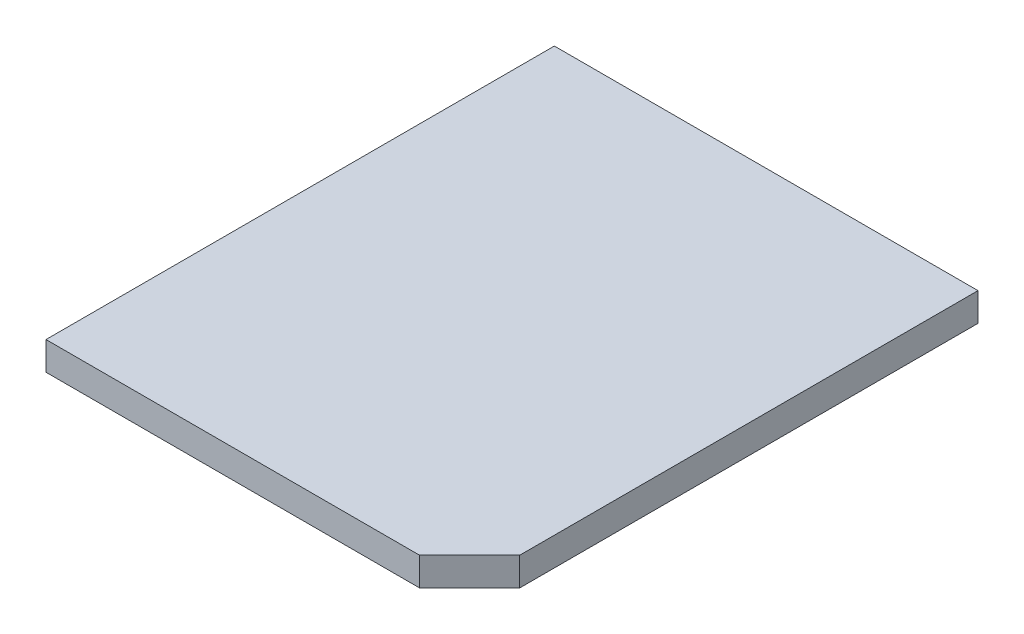
ISO-10303-21;
HEADER;
FILE_DESCRIPTION(('STEP AP214'),'2;1');
FILE_NAME('part.step','',(''),(''),'','','');
FILE_SCHEMA(('AUTOMOTIVE_DESIGN { 1 0 10303 214 1 1 1 1 }'));
ENDSEC;
DATA;
#1=APPLICATION_CONTEXT('core data for automotive mechanical design processes');
#2=APPLICATION_PROTOCOL_DEFINITION('international standard','automotive_design',2000,#1);
#3=PRODUCT_CONTEXT('',#1,'mechanical');
#4=PRODUCT('Part','Part','',(#3));
#5=PRODUCT_RELATED_PRODUCT_CATEGORY('part','',(#4));
#6=PRODUCT_DEFINITION_FORMATION('','',#4);
#7=PRODUCT_DEFINITION_CONTEXT('part definition',#1,'design');
#8=PRODUCT_DEFINITION('design','',#6,#7);
#9=PRODUCT_DEFINITION_SHAPE('','',#8);
#10=(LENGTH_UNIT() NAMED_UNIT(*) SI_UNIT(.MILLI.,.METRE.));
#11=(NAMED_UNIT(*) PLANE_ANGLE_UNIT() SI_UNIT($,.RADIAN.));
#12=(NAMED_UNIT(*) SI_UNIT($,.STERADIAN.) SOLID_ANGLE_UNIT());
#13=UNCERTAINTY_MEASURE_WITH_UNIT(LENGTH_MEASURE(1.E-05),#10,'distance_accuracy_value','');
#14=(GEOMETRIC_REPRESENTATION_CONTEXT(3) GLOBAL_UNCERTAINTY_ASSIGNED_CONTEXT((#13)) GLOBAL_UNIT_ASSIGNED_CONTEXT((#10,
#11,#12)) REPRESENTATION_CONTEXT('',''));
#15=CARTESIAN_POINT('',(0.,0.,0.));
#16=DIRECTION('',(0.,0.,1.));
#17=DIRECTION('',(1.,0.,0.));
#18=AXIS2_PLACEMENT_3D('',#15,#16,#17);
#19=CARTESIAN_POINT('',(0.,1.7,0.));
#20=DIRECTION('',(1.,0.,0.));
#21=DIRECTION('',(0.,0.,-1.));
#22=AXIS2_PLACEMENT_3D('',#19,#20,#21);
#23=PLANE('',#22);
#24=DIRECTION('',(0.,0.,1.));
#25=VECTOR('',#24,1.);
#26=CARTESIAN_POINT('',(0.,0.,0.));
#27=LINE('',#26,#25);
#28=CARTESIAN_POINT('',(0.,0.,-30.48));
#29=VERTEX_POINT('',#28);
#30=CARTESIAN_POINT('',(0.,0.,0.));
#31=VERTEX_POINT('',#30);
#32=EDGE_CURVE('E101',#29,#31,#27,.T.);
#33=ORIENTED_EDGE('',*,*,#32,.T.);
#34=DIRECTION('',(0.,-1.,0.));
#35=VECTOR('',#34,1.);
#36=CARTESIAN_POINT('',(0.,1.7,0.));
#37=LINE('',#36,#35);
#38=CARTESIAN_POINT('',(0.,1.7,0.));
#39=VERTEX_POINT('',#38);
#40=EDGE_CURVE('E84',#39,#31,#37,.T.);
#41=ORIENTED_EDGE('',*,*,#40,.F.);
#42=DIRECTION('',(0.,0.,1.));
#43=VECTOR('',#42,1.);
#44=CARTESIAN_POINT('',(0.,1.7,0.));
#45=LINE('',#44,#43);
#46=CARTESIAN_POINT('',(0.,1.7,-30.48));
#47=VERTEX_POINT('',#46);
#48=EDGE_CURVE('E89',#47,#39,#45,.T.);
#49=ORIENTED_EDGE('',*,*,#48,.F.);
#50=DIRECTION('',(0.,-1.,0.));
#51=VECTOR('',#50,1.);
#52=CARTESIAN_POINT('',(0.,1.7,-30.48));
#53=LINE('',#52,#51);
#54=EDGE_CURVE('E108',#47,#29,#53,.T.);
#55=ORIENTED_EDGE('',*,*,#54,.T.);
#56=EDGE_LOOP('',(#33,#41,#49,#55));
#57=FACE_BOUND('',#56,.T.);
#58=ADVANCED_FACE('F36',(#57),#23,.F.);
#59=CARTESIAN_POINT('',(0.,1.7,0.));
#60=DIRECTION('',(0.,0.,-1.));
#61=DIRECTION('',(-1.,0.,0.));
#62=AXIS2_PLACEMENT_3D('',#59,#60,#61);
#63=PLANE('',#62);
#64=DIRECTION('',(1.,0.,0.));
#65=VECTOR('',#64,1.);
#66=CARTESIAN_POINT('',(0.,0.,0.));
#67=LINE('',#66,#65);
#68=CARTESIAN_POINT('',(22.4,0.,0.));
#69=VERTEX_POINT('',#68);
#70=EDGE_CURVE('E116',#31,#69,#67,.T.);
#71=ORIENTED_EDGE('',*,*,#70,.T.);
#72=DIRECTION('',(0.,1.,0.));
#73=VECTOR('',#72,1.);
#74=CARTESIAN_POINT('',(22.4,1.7,0.));
#75=LINE('',#74,#73);
#76=CARTESIAN_POINT('',(22.4,1.7,0.));
#77=VERTEX_POINT('',#76);
#78=EDGE_CURVE('E45',#69,#77,#75,.T.);
#79=ORIENTED_EDGE('',*,*,#78,.T.);
#80=DIRECTION('',(1.,0.,0.));
#81=VECTOR('',#80,1.);
#82=CARTESIAN_POINT('',(0.,1.7,0.));
#83=LINE('',#82,#81);
#84=EDGE_CURVE('E80',#39,#77,#83,.T.);
#85=ORIENTED_EDGE('',*,*,#84,.F.);
#86=ORIENTED_EDGE('',*,*,#40,.T.);
#87=EDGE_LOOP('',(#71,#79,#85,#86));
#88=FACE_BOUND('',#87,.T.);
#89=ADVANCED_FACE('F82',(#88),#63,.F.);
#90=CARTESIAN_POINT('',(25.4,1.7,0.));
#91=DIRECTION('',(-1.,0.,0.));
#92=DIRECTION('',(0.,0.,1.));
#93=AXIS2_PLACEMENT_3D('',#90,#91,#92);
#94=PLANE('',#93);
#95=DIRECTION('',(0.,0.,-1.));
#96=VECTOR('',#95,1.);
#97=CARTESIAN_POINT('',(25.4,1.7,0.));
#98=LINE('',#97,#96);
#99=CARTESIAN_POINT('',(25.4,1.7,-3.));
#100=VERTEX_POINT('',#99);
#101=CARTESIAN_POINT('',(25.4,1.7,-30.48));
#102=VERTEX_POINT('',#101);
#103=EDGE_CURVE('E88',#100,#102,#98,.T.);
#104=ORIENTED_EDGE('',*,*,#103,.F.);
#105=DIRECTION('',(0.,-1.,0.));
#106=VECTOR('',#105,1.);
#107=CARTESIAN_POINT('',(25.4,1.7,-3.));
#108=LINE('',#107,#106);
#109=CARTESIAN_POINT('',(25.4,0.,-3.));
#110=VERTEX_POINT('',#109);
#111=EDGE_CURVE('E102',#100,#110,#108,.T.);
#112=ORIENTED_EDGE('',*,*,#111,.T.);
#113=DIRECTION('',(0.,0.,-1.));
#114=VECTOR('',#113,1.);
#115=CARTESIAN_POINT('',(25.4,0.,0.));
#116=LINE('',#115,#114);
#117=CARTESIAN_POINT('',(25.4,0.,-30.48));
#118=VERTEX_POINT('',#117);
#119=EDGE_CURVE('E114',#110,#118,#116,.T.);
#120=ORIENTED_EDGE('',*,*,#119,.T.);
#121=DIRECTION('',(0.,-1.,0.));
#122=VECTOR('',#121,1.);
#123=CARTESIAN_POINT('',(25.4,1.7,-30.48));
#124=LINE('',#123,#122);
#125=EDGE_CURVE('E103',#102,#118,#124,.T.);
#126=ORIENTED_EDGE('',*,*,#125,.F.);
#127=EDGE_LOOP('',(#104,#112,#120,#126));
#128=FACE_BOUND('',#127,.T.);
#129=ADVANCED_FACE('F124',(#128),#94,.F.);
#130=CARTESIAN_POINT('',(0.,1.7,-30.48));
#131=DIRECTION('',(0.,0.,1.));
#132=DIRECTION('',(1.,0.,0.));
#133=AXIS2_PLACEMENT_3D('',#130,#131,#132);
#134=PLANE('',#133);
#135=DIRECTION('',(-1.,0.,0.));
#136=VECTOR('',#135,1.);
#137=CARTESIAN_POINT('',(0.,0.,-30.48));
#138=LINE('',#137,#136);
#139=EDGE_CURVE('E98',#118,#29,#138,.T.);
#140=ORIENTED_EDGE('',*,*,#139,.T.);
#141=ORIENTED_EDGE('',*,*,#54,.F.);
#142=DIRECTION('',(-1.,0.,0.));
#143=VECTOR('',#142,1.);
#144=CARTESIAN_POINT('',(0.,1.7,-30.48));
#145=LINE('',#144,#143);
#146=EDGE_CURVE('E94',#102,#47,#145,.T.);
#147=ORIENTED_EDGE('',*,*,#146,.F.);
#148=ORIENTED_EDGE('',*,*,#125,.T.);
#149=EDGE_LOOP('',(#140,#141,#147,#148));
#150=FACE_BOUND('',#149,.T.);
#151=ADVANCED_FACE('F127',(#150),#134,.F.);
#152=CARTESIAN_POINT('',(0.,1.7,0.));
#153=DIRECTION('',(0.,-1.,0.));
#154=DIRECTION('',(0.,0.,-1.));
#155=AXIS2_PLACEMENT_3D('',#152,#153,#154);
#156=PLANE('',#155);
#157=ORIENTED_EDGE('',*,*,#84,.T.);
#158=DIRECTION('',(-0.707106781186549,0.,0.707106781186546));
#159=VECTOR('',#158,1.);
#160=CARTESIAN_POINT('',(25.4,1.7,-3.));
#161=LINE('',#160,#159);
#162=EDGE_CURVE('E11',#77,#100,#161,.F.);
#163=ORIENTED_EDGE('',*,*,#162,.T.);
#164=ORIENTED_EDGE('',*,*,#103,.T.);
#165=ORIENTED_EDGE('',*,*,#146,.T.);
#166=ORIENTED_EDGE('',*,*,#48,.T.);
#167=EDGE_LOOP('',(#157,#163,#164,#165,#166));
#168=FACE_BOUND('',#167,.T.);
#169=ADVANCED_FACE('F92',(#168),#156,.F.);
#170=CARTESIAN_POINT('',(0.,0.,0.));
#171=DIRECTION('',(0.,-1.,0.));
#172=DIRECTION('',(0.,0.,-1.));
#173=AXIS2_PLACEMENT_3D('',#170,#171,#172);
#174=PLANE('',#173);
#175=ORIENTED_EDGE('',*,*,#119,.F.);
#176=DIRECTION('',(0.707106781186549,0.,-0.707106781186546));
#177=VECTOR('',#176,1.);
#178=CARTESIAN_POINT('',(11.2,0.,11.2));
#179=LINE('',#178,#177);
#180=EDGE_CURVE('E59',#110,#69,#179,.F.);
#181=ORIENTED_EDGE('',*,*,#180,.T.);
#182=ORIENTED_EDGE('',*,*,#70,.F.);
#183=ORIENTED_EDGE('',*,*,#32,.F.);
#184=ORIENTED_EDGE('',*,*,#139,.F.);
#185=EDGE_LOOP('',(#175,#181,#182,#183,#184));
#186=FACE_BOUND('',#185,.T.);
#187=ADVANCED_FACE('F128',(#186),#174,.T.);
#188=CARTESIAN_POINT('',(25.4,1.7,-3.));
#189=DIRECTION('',(-0.707106781186546,0.,-0.707106781186549));
#190=DIRECTION('',(0.,-1.,0.));
#191=AXIS2_PLACEMENT_3D('',#188,#189,#190);
#192=PLANE('',#191);
#193=ORIENTED_EDGE('',*,*,#162,.F.);
#194=ORIENTED_EDGE('',*,*,#78,.F.);
#195=ORIENTED_EDGE('',*,*,#180,.F.);
#196=ORIENTED_EDGE('',*,*,#111,.F.);
#197=EDGE_LOOP('',(#193,#194,#195,#196));
#198=FACE_BOUND('',#197,.T.);
#199=ADVANCED_FACE('F39',(#198),#192,.F.);
#200=CLOSED_SHELL('',(#58,#89,#129,#151,#169,#187,#199));
#201=MANIFOLD_SOLID_BREP('B2',#200);
#202=ADVANCED_BREP_SHAPE_REPRESENTATION('',(#18,#201),#14);
#203=SHAPE_DEFINITION_REPRESENTATION(#9,#202);
ENDSEC;
END-ISO-10303-21;
